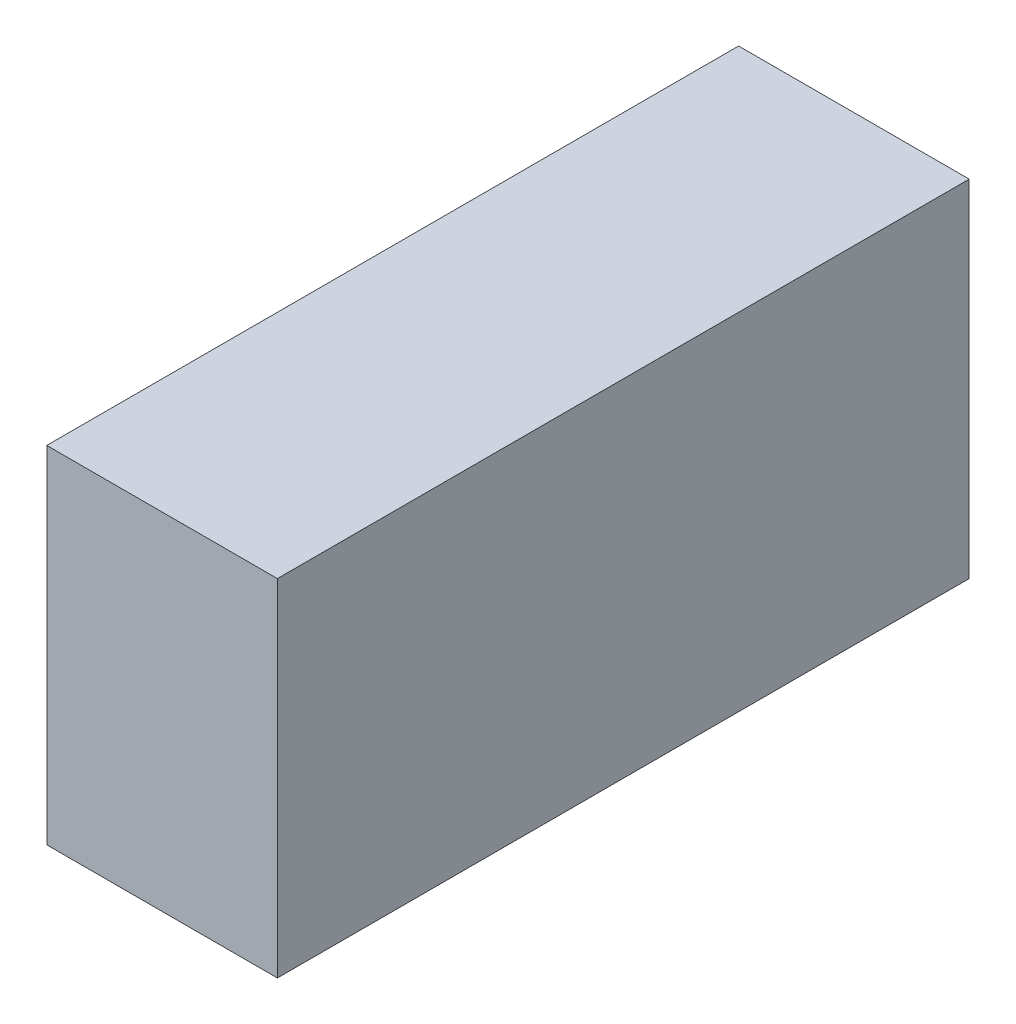
ISO-10303-21;
HEADER;
FILE_DESCRIPTION(('STEP AP214'),'2;1');
FILE_NAME('part.step','',(''),(''),'','','');
FILE_SCHEMA(('AUTOMOTIVE_DESIGN { 1 0 10303 214 1 1 1 1 }'));
ENDSEC;
DATA;
#1=APPLICATION_CONTEXT('core data for automotive mechanical design processes');
#2=APPLICATION_PROTOCOL_DEFINITION('international standard','automotive_design',2000,#1);
#3=PRODUCT_CONTEXT('',#1,'mechanical');
#4=PRODUCT('Part','Part','',(#3));
#5=PRODUCT_RELATED_PRODUCT_CATEGORY('part','',(#4));
#6=PRODUCT_DEFINITION_FORMATION('','',#4);
#7=PRODUCT_DEFINITION_CONTEXT('part definition',#1,'design');
#8=PRODUCT_DEFINITION('design','',#6,#7);
#9=PRODUCT_DEFINITION_SHAPE('','',#8);
#10=(LENGTH_UNIT() NAMED_UNIT(*) SI_UNIT(.MILLI.,.METRE.));
#11=(NAMED_UNIT(*) PLANE_ANGLE_UNIT() SI_UNIT($,.RADIAN.));
#12=(NAMED_UNIT(*) SI_UNIT($,.STERADIAN.) SOLID_ANGLE_UNIT());
#13=UNCERTAINTY_MEASURE_WITH_UNIT(LENGTH_MEASURE(1.E-05),#10,'distance_accuracy_value','');
#14=(GEOMETRIC_REPRESENTATION_CONTEXT(3) GLOBAL_UNCERTAINTY_ASSIGNED_CONTEXT((#13)) GLOBAL_UNIT_ASSIGNED_CONTEXT((#10,
#11,#12)) REPRESENTATION_CONTEXT('',''));
#15=CARTESIAN_POINT('',(0.,0.,0.));
#16=DIRECTION('',(0.,0.,1.));
#17=DIRECTION('',(1.,0.,0.));
#18=AXIS2_PLACEMENT_3D('',#15,#16,#17);
#19=CARTESIAN_POINT('',(304.8,0.,0.));
#20=DIRECTION('',(0.,0.,-1.));
#21=DIRECTION('',(-1.,0.,0.));
#22=AXIS2_PLACEMENT_3D('',#19,#20,#21);
#23=PLANE('',#22);
#24=DIRECTION('',(0.,-1.,0.));
#25=VECTOR('',#24,1.);
#26=CARTESIAN_POINT('',(0.,0.,0.));
#27=LINE('',#26,#25);
#28=CARTESIAN_POINT('',(0.,457.2,0.));
#29=VERTEX_POINT('',#28);
#30=CARTESIAN_POINT('',(0.,0.,0.));
#31=VERTEX_POINT('',#30);
#32=EDGE_CURVE('E107',#29,#31,#27,.T.);
#33=ORIENTED_EDGE('',*,*,#32,.T.);
#34=DIRECTION('',(-1.,0.,0.));
#35=VECTOR('',#34,1.);
#36=CARTESIAN_POINT('',(304.8,0.,0.));
#37=LINE('',#36,#35);
#38=CARTESIAN_POINT('',(304.8,0.,0.));
#39=VERTEX_POINT('',#38);
#40=EDGE_CURVE('E11',#39,#31,#37,.T.);
#41=ORIENTED_EDGE('',*,*,#40,.F.);
#42=DIRECTION('',(0.,-1.,0.));
#43=VECTOR('',#42,1.);
#44=CARTESIAN_POINT('',(304.8,0.,0.));
#45=LINE('',#44,#43);
#46=CARTESIAN_POINT('',(304.8,457.2,0.));
#47=VERTEX_POINT('',#46);
#48=EDGE_CURVE('E91',#47,#39,#45,.T.);
#49=ORIENTED_EDGE('',*,*,#48,.F.);
#50=DIRECTION('',(-1.,0.,0.));
#51=VECTOR('',#50,1.);
#52=CARTESIAN_POINT('',(304.8,457.2,0.));
#53=LINE('',#52,#51);
#54=EDGE_CURVE('E103',#47,#29,#53,.T.);
#55=ORIENTED_EDGE('',*,*,#54,.T.);
#56=EDGE_LOOP('',(#33,#41,#49,#55));
#57=FACE_BOUND('',#56,.T.);
#58=ADVANCED_FACE('F39',(#57),#23,.F.);
#59=CARTESIAN_POINT('',(304.8,0.,0.));
#60=DIRECTION('',(0.,1.,0.));
#61=DIRECTION('',(0.,0.,1.));
#62=AXIS2_PLACEMENT_3D('',#59,#60,#61);
#63=PLANE('',#62);
#64=DIRECTION('',(0.,0.,-1.));
#65=VECTOR('',#64,1.);
#66=CARTESIAN_POINT('',(0.,0.,0.));
#67=LINE('',#66,#65);
#68=CARTESIAN_POINT('',(0.,0.,-914.4));
#69=VERTEX_POINT('',#68);
#70=EDGE_CURVE('E96',#31,#69,#67,.T.);
#71=ORIENTED_EDGE('',*,*,#70,.T.);
#72=DIRECTION('',(-1.,0.,0.));
#73=VECTOR('',#72,1.);
#74=CARTESIAN_POINT('',(304.8,0.,-914.4));
#75=LINE('',#74,#73);
#76=CARTESIAN_POINT('',(304.8,0.,-914.4));
#77=VERTEX_POINT('',#76);
#78=EDGE_CURVE('E48',#77,#69,#75,.T.);
#79=ORIENTED_EDGE('',*,*,#78,.F.);
#80=DIRECTION('',(0.,0.,-1.));
#81=VECTOR('',#80,1.);
#82=CARTESIAN_POINT('',(304.8,0.,0.));
#83=LINE('',#82,#81);
#84=EDGE_CURVE('E86',#39,#77,#83,.T.);
#85=ORIENTED_EDGE('',*,*,#84,.F.);
#86=ORIENTED_EDGE('',*,*,#40,.T.);
#87=EDGE_LOOP('',(#71,#79,#85,#86));
#88=FACE_BOUND('',#87,.T.);
#89=ADVANCED_FACE('F95',(#88),#63,.F.);
#90=CARTESIAN_POINT('',(304.8,0.,-914.4));
#91=DIRECTION('',(0.,0.,1.));
#92=DIRECTION('',(1.,0.,0.));
#93=AXIS2_PLACEMENT_3D('',#90,#91,#92);
#94=PLANE('',#93);
#95=DIRECTION('',(0.,1.,0.));
#96=VECTOR('',#95,1.);
#97=CARTESIAN_POINT('',(0.,0.,-914.4));
#98=LINE('',#97,#96);
#99=CARTESIAN_POINT('',(0.,457.2,-914.4));
#100=VERTEX_POINT('',#99);
#101=EDGE_CURVE('E73',#69,#100,#98,.T.);
#102=ORIENTED_EDGE('',*,*,#101,.T.);
#103=DIRECTION('',(-1.,0.,0.));
#104=VECTOR('',#103,1.);
#105=CARTESIAN_POINT('',(304.8,457.2,-914.4));
#106=LINE('',#105,#104);
#107=CARTESIAN_POINT('',(304.8,457.2,-914.4));
#108=VERTEX_POINT('',#107);
#109=EDGE_CURVE('E98',#108,#100,#106,.T.);
#110=ORIENTED_EDGE('',*,*,#109,.F.);
#111=DIRECTION('',(0.,1.,0.));
#112=VECTOR('',#111,1.);
#113=CARTESIAN_POINT('',(304.8,0.,-914.4));
#114=LINE('',#113,#112);
#115=EDGE_CURVE('E89',#77,#108,#114,.T.);
#116=ORIENTED_EDGE('',*,*,#115,.F.);
#117=ORIENTED_EDGE('',*,*,#78,.T.);
#118=EDGE_LOOP('',(#102,#110,#116,#117));
#119=FACE_BOUND('',#118,.T.);
#120=ADVANCED_FACE('F99',(#119),#94,.F.);
#121=CARTESIAN_POINT('',(304.8,457.2,0.));
#122=DIRECTION('',(0.,-1.,0.));
#123=DIRECTION('',(0.,0.,-1.));
#124=AXIS2_PLACEMENT_3D('',#121,#122,#123);
#125=PLANE('',#124);
#126=DIRECTION('',(0.,0.,1.));
#127=VECTOR('',#126,1.);
#128=CARTESIAN_POINT('',(0.,457.2,0.));
#129=LINE('',#128,#127);
#130=EDGE_CURVE('E79',#100,#29,#129,.T.);
#131=ORIENTED_EDGE('',*,*,#130,.T.);
#132=ORIENTED_EDGE('',*,*,#54,.F.);
#133=DIRECTION('',(0.,0.,1.));
#134=VECTOR('',#133,1.);
#135=CARTESIAN_POINT('',(304.8,457.2,0.));
#136=LINE('',#135,#134);
#137=EDGE_CURVE('E56',#108,#47,#136,.T.);
#138=ORIENTED_EDGE('',*,*,#137,.F.);
#139=ORIENTED_EDGE('',*,*,#109,.T.);
#140=EDGE_LOOP('',(#131,#132,#138,#139));
#141=FACE_BOUND('',#140,.T.);
#142=ADVANCED_FACE('F120',(#141),#125,.F.);
#143=CARTESIAN_POINT('',(304.8,0.,0.));
#144=DIRECTION('',(-1.,0.,0.));
#145=DIRECTION('',(0.,0.,1.));
#146=AXIS2_PLACEMENT_3D('',#143,#144,#145);
#147=PLANE('',#146);
#148=ORIENTED_EDGE('',*,*,#48,.T.);
#149=ORIENTED_EDGE('',*,*,#84,.T.);
#150=ORIENTED_EDGE('',*,*,#115,.T.);
#151=ORIENTED_EDGE('',*,*,#137,.T.);
#152=EDGE_LOOP('',(#148,#149,#150,#151));
#153=FACE_BOUND('',#152,.T.);
#154=ADVANCED_FACE('F87',(#153),#147,.F.);
#155=CARTESIAN_POINT('',(0.,0.,0.));
#156=DIRECTION('',(-1.,0.,0.));
#157=DIRECTION('',(0.,0.,1.));
#158=AXIS2_PLACEMENT_3D('',#155,#156,#157);
#159=PLANE('',#158);
#160=ORIENTED_EDGE('',*,*,#32,.F.);
#161=ORIENTED_EDGE('',*,*,#130,.F.);
#162=ORIENTED_EDGE('',*,*,#101,.F.);
#163=ORIENTED_EDGE('',*,*,#70,.F.);
#164=EDGE_LOOP('',(#160,#161,#162,#163));
#165=FACE_BOUND('',#164,.T.);
#166=ADVANCED_FACE('F123',(#165),#159,.T.);
#167=CLOSED_SHELL('',(#58,#89,#120,#142,#154,#166));
#168=MANIFOLD_SOLID_BREP('B2',#167);
#169=ADVANCED_BREP_SHAPE_REPRESENTATION('',(#18,#168),#14);
#170=SHAPE_DEFINITION_REPRESENTATION(#9,#169);
ENDSEC;
END-ISO-10303-21;
